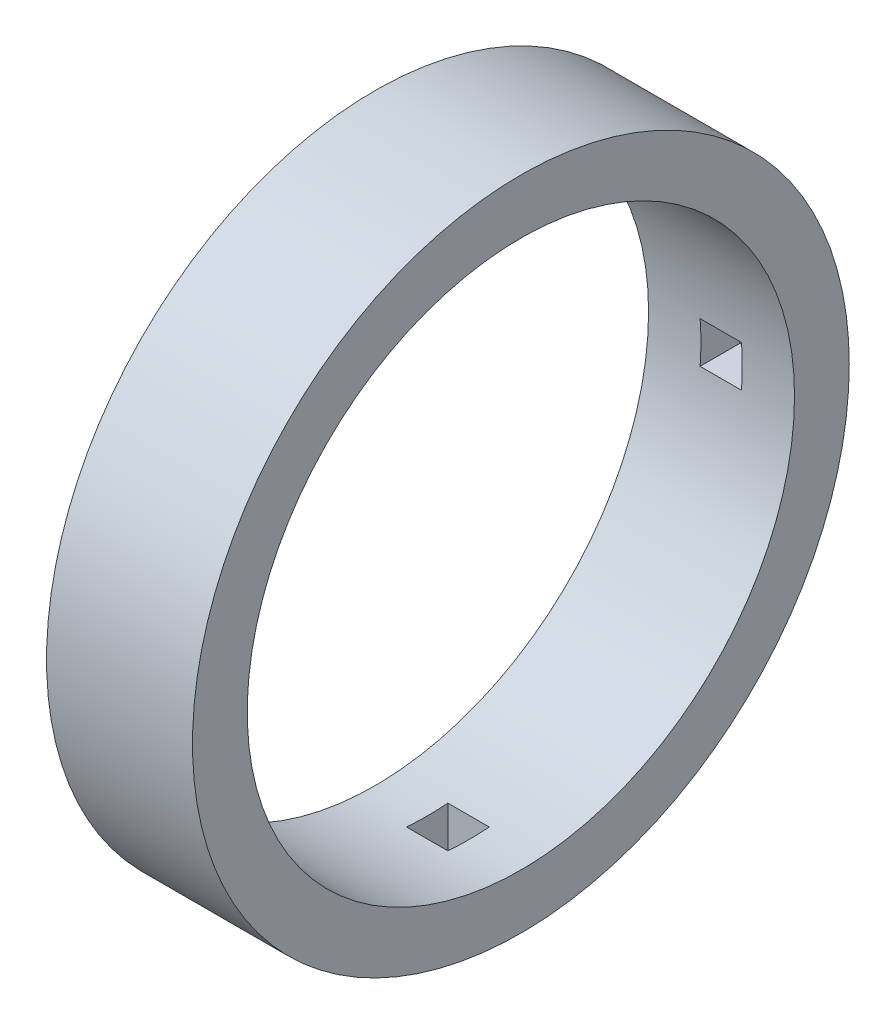
ISO-10303-21;
HEADER;
FILE_DESCRIPTION(('STEP AP214'),'2;1');
FILE_NAME('part.step','',(''),(''),'','','');
FILE_SCHEMA(('AUTOMOTIVE_DESIGN { 1 0 10303 214 1 1 1 1 }'));
ENDSEC;
DATA;
#1=APPLICATION_CONTEXT('core data for automotive mechanical design processes');
#2=APPLICATION_PROTOCOL_DEFINITION('international standard','automotive_design',2000,#1);
#3=PRODUCT_CONTEXT('',#1,'mechanical');
#4=PRODUCT('Part','Part','',(#3));
#5=PRODUCT_RELATED_PRODUCT_CATEGORY('part','',(#4));
#6=PRODUCT_DEFINITION_FORMATION('','',#4);
#7=PRODUCT_DEFINITION_CONTEXT('part definition',#1,'design');
#8=PRODUCT_DEFINITION('design','',#6,#7);
#9=PRODUCT_DEFINITION_SHAPE('','',#8);
#10=(LENGTH_UNIT() NAMED_UNIT(*) SI_UNIT(.MILLI.,.METRE.));
#11=(NAMED_UNIT(*) PLANE_ANGLE_UNIT() SI_UNIT($,.RADIAN.));
#12=(NAMED_UNIT(*) SI_UNIT($,.STERADIAN.) SOLID_ANGLE_UNIT());
#13=UNCERTAINTY_MEASURE_WITH_UNIT(LENGTH_MEASURE(1.E-05),#10,'distance_accuracy_value','');
#14=(GEOMETRIC_REPRESENTATION_CONTEXT(3) GLOBAL_UNCERTAINTY_ASSIGNED_CONTEXT((#13)) GLOBAL_UNIT_ASSIGNED_CONTEXT((#10,
#11,#12)) REPRESENTATION_CONTEXT('',''));
#15=CARTESIAN_POINT('',(0.,0.,0.));
#16=DIRECTION('',(0.,0.,1.));
#17=DIRECTION('',(1.,0.,0.));
#18=AXIS2_PLACEMENT_3D('',#15,#16,#17);
#19=CARTESIAN_POINT('',(12.,0.,0.));
#20=DIRECTION('',(-1.,0.,0.));
#21=DIRECTION('',(0.,0.,1.));
#22=AXIS2_PLACEMENT_3D('',#19,#20,#21);
#23=CYLINDRICAL_SURFACE('',#22,22.5);
#24=DIRECTION('',(-1.,0.,0.));
#25=VECTOR('',#24,1.);
#26=CARTESIAN_POINT('',(12.,-1.7,-22.4356858598083));
#27=LINE('',#26,#25);
#28=CARTESIAN_POINT('',(7.7,-1.7,-22.4356858598083));
#29=VERTEX_POINT('',#28);
#30=CARTESIAN_POINT('',(4.3,-1.7,-22.4356858598083));
#31=VERTEX_POINT('',#30);
#32=EDGE_CURVE('E253',#29,#31,#27,.T.);
#33=ORIENTED_EDGE('',*,*,#32,.T.);
#34=CARTESIAN_POINT('',(4.3,0.,0.));
#35=DIRECTION('',(1.,0.,0.));
#36=DIRECTION('',(0.,0.,-1.));
#37=AXIS2_PLACEMENT_3D('',#34,#35,#36);
#38=CIRCLE('',#37,22.5);
#39=CARTESIAN_POINT('',(4.3,1.7,-22.4356858598083));
#40=VERTEX_POINT('',#39);
#41=EDGE_CURVE('E261',#31,#40,#38,.T.);
#42=ORIENTED_EDGE('',*,*,#41,.T.);
#43=DIRECTION('',(-1.,0.,0.));
#44=VECTOR('',#43,1.);
#45=CARTESIAN_POINT('',(12.,1.7,-22.4356858598083));
#46=LINE('',#45,#44);
#47=CARTESIAN_POINT('',(7.7,1.7,-22.4356858598083));
#48=VERTEX_POINT('',#47);
#49=EDGE_CURVE('E250',#40,#48,#46,.F.);
#50=ORIENTED_EDGE('',*,*,#49,.T.);
#51=CARTESIAN_POINT('',(7.7,0.,0.));
#52=DIRECTION('',(1.,0.,0.));
#53=DIRECTION('',(0.,0.,-1.));
#54=AXIS2_PLACEMENT_3D('',#51,#52,#53);
#55=CIRCLE('',#54,22.5);
#56=EDGE_CURVE('E247',#29,#48,#55,.T.);
#57=ORIENTED_EDGE('',*,*,#56,.F.);
#58=EDGE_LOOP('',(#33,#42,#50,#57));
#59=FACE_BOUND('',#58,.T.);
#60=CARTESIAN_POINT('',(0.,0.,0.));
#61=DIRECTION('',(1.,0.,0.));
#62=DIRECTION('',(0.,0.,-1.));
#63=AXIS2_PLACEMENT_3D('',#60,#61,#62);
#64=CIRCLE('',#63,22.5);
#65=CARTESIAN_POINT('',(0.,0.,-22.5));
#66=VERTEX_POINT('',#65);
#67=EDGE_CURVE('E313',#66,#66,#64,.T.);
#68=ORIENTED_EDGE('',*,*,#67,.F.);
#69=EDGE_LOOP('',(#68));
#70=FACE_BOUND('',#69,.T.);
#71=CARTESIAN_POINT('',(12.,0.,0.));
#72=DIRECTION('',(1.,0.,0.));
#73=DIRECTION('',(0.,0.,-1.));
#74=AXIS2_PLACEMENT_3D('',#71,#72,#73);
#75=CIRCLE('',#74,22.5);
#76=CARTESIAN_POINT('',(12.,0.,-22.5));
#77=VERTEX_POINT('',#76);
#78=EDGE_CURVE('E314',#77,#77,#75,.T.);
#79=ORIENTED_EDGE('',*,*,#78,.T.);
#80=EDGE_LOOP('',(#79));
#81=FACE_BOUND('',#80,.T.);
#82=CARTESIAN_POINT('',(4.3,0.,0.));
#83=DIRECTION('',(-1.,0.,0.));
#84=DIRECTION('',(0.,0.,1.));
#85=AXIS2_PLACEMENT_3D('',#82,#83,#84);
#86=CIRCLE('',#85,22.5);
#87=CARTESIAN_POINT('',(4.3,-1.7,22.4356858598083));
#88=VERTEX_POINT('',#87);
#89=CARTESIAN_POINT('',(4.3,1.7,22.4356858598083));
#90=VERTEX_POINT('',#89);
#91=EDGE_CURVE('E336',#88,#90,#86,.T.);
#92=ORIENTED_EDGE('',*,*,#91,.F.);
#93=DIRECTION('',(-1.,0.,0.));
#94=VECTOR('',#93,1.);
#95=CARTESIAN_POINT('',(12.,-1.7,22.4356858598083));
#96=LINE('',#95,#94);
#97=CARTESIAN_POINT('',(7.7,-1.7,22.4356858598083));
#98=VERTEX_POINT('',#97);
#99=EDGE_CURVE('E330',#88,#98,#96,.F.);
#100=ORIENTED_EDGE('',*,*,#99,.T.);
#101=CARTESIAN_POINT('',(7.7,0.,0.));
#102=DIRECTION('',(-1.,0.,0.));
#103=DIRECTION('',(0.,0.,1.));
#104=AXIS2_PLACEMENT_3D('',#101,#102,#103);
#105=CIRCLE('',#104,22.5);
#106=CARTESIAN_POINT('',(7.7,1.7,22.4356858598083));
#107=VERTEX_POINT('',#106);
#108=EDGE_CURVE('E326',#98,#107,#105,.T.);
#109=ORIENTED_EDGE('',*,*,#108,.T.);
#110=DIRECTION('',(-1.,0.,0.));
#111=VECTOR('',#110,1.);
#112=CARTESIAN_POINT('',(12.,1.7,22.4356858598083));
#113=LINE('',#112,#111);
#114=EDGE_CURVE('E333',#107,#90,#113,.T.);
#115=ORIENTED_EDGE('',*,*,#114,.T.);
#116=EDGE_LOOP('',(#92,#100,#109,#115));
#117=FACE_BOUND('',#116,.T.);
#118=DIRECTION('',(-1.,0.,0.));
#119=VECTOR('',#118,1.);
#120=CARTESIAN_POINT('',(12.,22.4356858598082,-1.70000000000008));
#121=LINE('',#120,#119);
#122=CARTESIAN_POINT('',(7.7,22.4356858598082,-1.70000000000008));
#123=VERTEX_POINT('',#122);
#124=CARTESIAN_POINT('',(4.3,22.4356858598082,-1.70000000000008));
#125=VERTEX_POINT('',#124);
#126=EDGE_CURVE('E256',#123,#125,#121,.T.);
#127=ORIENTED_EDGE('',*,*,#126,.T.);
#128=CARTESIAN_POINT('',(4.3,0.,0.));
#129=DIRECTION('',(1.,0.,0.));
#130=DIRECTION('',(0.,0.,-1.));
#131=AXIS2_PLACEMENT_3D('',#128,#129,#130);
#132=CIRCLE('',#131,22.5);
#133=CARTESIAN_POINT('',(4.3,22.4356858598083,1.69999999999992));
#134=VERTEX_POINT('',#133);
#135=EDGE_CURVE('E251',#125,#134,#132,.T.);
#136=ORIENTED_EDGE('',*,*,#135,.T.);
#137=DIRECTION('',(-1.,0.,0.));
#138=VECTOR('',#137,1.);
#139=CARTESIAN_POINT('',(12.,22.4356858598083,1.69999999999992));
#140=LINE('',#139,#138);
#141=CARTESIAN_POINT('',(7.7,22.4356858598083,1.69999999999992));
#142=VERTEX_POINT('',#141);
#143=EDGE_CURVE('E340',#134,#142,#140,.F.);
#144=ORIENTED_EDGE('',*,*,#143,.T.);
#145=CARTESIAN_POINT('',(7.7,0.,0.));
#146=DIRECTION('',(1.,0.,0.));
#147=DIRECTION('',(0.,0.,-1.));
#148=AXIS2_PLACEMENT_3D('',#145,#146,#147);
#149=CIRCLE('',#148,22.5);
#150=EDGE_CURVE('E338',#123,#142,#149,.T.);
#151=ORIENTED_EDGE('',*,*,#150,.F.);
#152=EDGE_LOOP('',(#127,#136,#144,#151));
#153=FACE_BOUND('',#152,.T.);
#154=DIRECTION('',(-1.,0.,0.));
#155=VECTOR('',#154,1.);
#156=CARTESIAN_POINT('',(12.,-22.4356858598082,1.70000000000023));
#157=LINE('',#156,#155);
#158=CARTESIAN_POINT('',(7.7,-22.4356858598082,1.70000000000023));
#159=VERTEX_POINT('',#158);
#160=CARTESIAN_POINT('',(4.3,-22.4356858598082,1.70000000000023));
#161=VERTEX_POINT('',#160);
#162=EDGE_CURVE('E47',#159,#161,#157,.T.);
#163=ORIENTED_EDGE('',*,*,#162,.T.);
#164=CARTESIAN_POINT('',(4.3,0.,0.));
#165=DIRECTION('',(1.,0.,0.));
#166=DIRECTION('',(0.,0.,-1.));
#167=AXIS2_PLACEMENT_3D('',#164,#165,#166);
#168=CIRCLE('',#167,22.5);
#169=CARTESIAN_POINT('',(4.3,-22.4356858598083,-1.69999999999977));
#170=VERTEX_POINT('',#169);
#171=EDGE_CURVE('E12',#161,#170,#168,.T.);
#172=ORIENTED_EDGE('',*,*,#171,.T.);
#173=DIRECTION('',(-1.,0.,0.));
#174=VECTOR('',#173,1.);
#175=CARTESIAN_POINT('',(12.,-22.4356858598083,-1.69999999999977));
#176=LINE('',#175,#174);
#177=CARTESIAN_POINT('',(7.7,-22.4356858598083,-1.69999999999977));
#178=VERTEX_POINT('',#177);
#179=EDGE_CURVE('E264',#170,#178,#176,.F.);
#180=ORIENTED_EDGE('',*,*,#179,.T.);
#181=CARTESIAN_POINT('',(7.7,0.,0.));
#182=DIRECTION('',(1.,0.,0.));
#183=DIRECTION('',(0.,0.,-1.));
#184=AXIS2_PLACEMENT_3D('',#181,#182,#183);
#185=CIRCLE('',#184,22.5);
#186=EDGE_CURVE('E174',#159,#178,#185,.T.);
#187=ORIENTED_EDGE('',*,*,#186,.F.);
#188=EDGE_LOOP('',(#163,#172,#180,#187));
#189=FACE_BOUND('',#188,.T.);
#190=ADVANCED_FACE('F39',(#59,#70,#81,#117,#153,#189),#23,.F.);
#191=CARTESIAN_POINT('',(12.,0.,0.));
#192=DIRECTION('',(1.,0.,0.));
#193=DIRECTION('',(0.,0.,-1.));
#194=AXIS2_PLACEMENT_3D('',#191,#192,#193);
#195=PLANE('',#194);
#196=CARTESIAN_POINT('',(12.,0.,0.));
#197=DIRECTION('',(1.,0.,0.));
#198=DIRECTION('',(0.,0.,-1.));
#199=AXIS2_PLACEMENT_3D('',#196,#197,#198);
#200=CIRCLE('',#199,27.);
#201=CARTESIAN_POINT('',(12.,0.,-27.));
#202=VERTEX_POINT('',#201);
#203=EDGE_CURVE('E323',#202,#202,#200,.T.);
#204=ORIENTED_EDGE('',*,*,#203,.T.);
#205=EDGE_LOOP('',(#204));
#206=FACE_BOUND('',#205,.T.);
#207=ORIENTED_EDGE('',*,*,#78,.F.);
#208=EDGE_LOOP('',(#207));
#209=FACE_BOUND('',#208,.T.);
#210=ADVANCED_FACE('F288',(#206,#209),#195,.T.);
#211=CARTESIAN_POINT('',(0.,0.,0.));
#212=DIRECTION('',(1.,0.,0.));
#213=DIRECTION('',(0.,0.,-1.));
#214=AXIS2_PLACEMENT_3D('',#211,#212,#213);
#215=PLANE('',#214);
#216=CARTESIAN_POINT('',(0.,0.,0.));
#217=DIRECTION('',(1.,0.,0.));
#218=DIRECTION('',(0.,0.,-1.));
#219=AXIS2_PLACEMENT_3D('',#216,#217,#218);
#220=CIRCLE('',#219,27.);
#221=CARTESIAN_POINT('',(0.,0.,-27.));
#222=VERTEX_POINT('',#221);
#223=EDGE_CURVE('E310',#222,#222,#220,.T.);
#224=ORIENTED_EDGE('',*,*,#223,.F.);
#225=EDGE_LOOP('',(#224));
#226=FACE_BOUND('',#225,.T.);
#227=ORIENTED_EDGE('',*,*,#67,.T.);
#228=EDGE_LOOP('',(#227));
#229=FACE_BOUND('',#228,.T.);
#230=ADVANCED_FACE('F293',(#226,#229),#215,.F.);
#231=CARTESIAN_POINT('',(12.,0.,0.));
#232=DIRECTION('',(-1.,0.,0.));
#233=DIRECTION('',(0.,0.,1.));
#234=AXIS2_PLACEMENT_3D('',#231,#232,#233);
#235=CYLINDRICAL_SURFACE('',#234,27.);
#236=ORIENTED_EDGE('',*,*,#203,.F.);
#237=EDGE_LOOP('',(#236));
#238=FACE_BOUND('',#237,.T.);
#239=ORIENTED_EDGE('',*,*,#223,.T.);
#240=EDGE_LOOP('',(#239));
#241=FACE_BOUND('',#240,.T.);
#242=ADVANCED_FACE('F41',(#238,#241),#235,.T.);
#243=CARTESIAN_POINT('',(4.3,0.,0.));
#244=DIRECTION('',(-1.,0.,0.));
#245=DIRECTION('',(0.,0.,1.));
#246=AXIS2_PLACEMENT_3D('',#243,#244,#245);
#247=PLANE('',#246);
#248=ORIENTED_EDGE('',*,*,#91,.T.);
#249=DIRECTION('',(0.,0.,1.));
#250=VECTOR('',#249,1.);
#251=CARTESIAN_POINT('',(4.3,1.7,25.7));
#252=LINE('',#251,#250);
#253=CARTESIAN_POINT('',(4.3,1.7,25.7));
#254=VERTEX_POINT('',#253);
#255=EDGE_CURVE('E564',#90,#254,#252,.T.);
#256=ORIENTED_EDGE('',*,*,#255,.T.);
#257=DIRECTION('',(0.,-1.,0.));
#258=VECTOR('',#257,1.);
#259=CARTESIAN_POINT('',(4.3,1.7,25.7));
#260=LINE('',#259,#258);
#261=CARTESIAN_POINT('',(4.3,-1.7,25.7));
#262=VERTEX_POINT('',#261);
#263=EDGE_CURVE('E315',#254,#262,#260,.T.);
#264=ORIENTED_EDGE('',*,*,#263,.T.);
#265=DIRECTION('',(0.,0.,-1.));
#266=VECTOR('',#265,1.);
#267=CARTESIAN_POINT('',(4.3,-1.7,25.7));
#268=LINE('',#267,#266);
#269=EDGE_CURVE('E567',#262,#88,#268,.T.);
#270=ORIENTED_EDGE('',*,*,#269,.T.);
#271=EDGE_LOOP('',(#248,#256,#264,#270));
#272=FACE_BOUND('',#271,.T.);
#273=ADVANCED_FACE('F298',(#272),#247,.F.);
#274=CARTESIAN_POINT('',(6.,1.7,25.7));
#275=DIRECTION('',(0.,-1.,0.));
#276=DIRECTION('',(0.,0.,-1.));
#277=AXIS2_PLACEMENT_3D('',#274,#275,#276);
#278=PLANE('',#277);
#279=DIRECTION('',(0.,0.,1.));
#280=VECTOR('',#279,1.);
#281=CARTESIAN_POINT('',(7.7,1.7,25.7));
#282=LINE('',#281,#280);
#283=CARTESIAN_POINT('',(7.7,1.7,25.7));
#284=VERTEX_POINT('',#283);
#285=EDGE_CURVE('E374',#107,#284,#282,.T.);
#286=ORIENTED_EDGE('',*,*,#285,.T.);
#287=DIRECTION('',(-1.,0.,0.));
#288=VECTOR('',#287,1.);
#289=CARTESIAN_POINT('',(6.,1.7,25.7));
#290=LINE('',#289,#288);
#291=EDGE_CURVE('E571',#284,#254,#290,.T.);
#292=ORIENTED_EDGE('',*,*,#291,.T.);
#293=ORIENTED_EDGE('',*,*,#255,.F.);
#294=ORIENTED_EDGE('',*,*,#114,.F.);
#295=EDGE_LOOP('',(#286,#292,#293,#294));
#296=FACE_BOUND('',#295,.T.);
#297=ADVANCED_FACE('F502',(#296),#278,.T.);
#298=CARTESIAN_POINT('',(6.,-1.7,25.7));
#299=DIRECTION('',(0.,1.,0.));
#300=DIRECTION('',(0.,0.,1.));
#301=AXIS2_PLACEMENT_3D('',#298,#299,#300);
#302=PLANE('',#301);
#303=ORIENTED_EDGE('',*,*,#269,.F.);
#304=DIRECTION('',(-1.,0.,0.));
#305=VECTOR('',#304,1.);
#306=CARTESIAN_POINT('',(6.,-1.7,25.7));
#307=LINE('',#306,#305);
#308=CARTESIAN_POINT('',(7.7,-1.7,25.7));
#309=VERTEX_POINT('',#308);
#310=EDGE_CURVE('E319',#309,#262,#307,.T.);
#311=ORIENTED_EDGE('',*,*,#310,.F.);
#312=DIRECTION('',(0.,0.,-1.));
#313=VECTOR('',#312,1.);
#314=CARTESIAN_POINT('',(7.7,-1.7,25.7));
#315=LINE('',#314,#313);
#316=EDGE_CURVE('E577',#309,#98,#315,.T.);
#317=ORIENTED_EDGE('',*,*,#316,.T.);
#318=ORIENTED_EDGE('',*,*,#99,.F.);
#319=EDGE_LOOP('',(#303,#311,#317,#318));
#320=FACE_BOUND('',#319,.T.);
#321=ADVANCED_FACE('F493',(#320),#302,.T.);
#322=CARTESIAN_POINT('',(6.,1.7,25.7));
#323=DIRECTION('',(0.,0.,-1.));
#324=DIRECTION('',(-1.,0.,0.));
#325=AXIS2_PLACEMENT_3D('',#322,#323,#324);
#326=PLANE('',#325);
#327=ORIENTED_EDGE('',*,*,#263,.F.);
#328=ORIENTED_EDGE('',*,*,#291,.F.);
#329=DIRECTION('',(0.,-1.,0.));
#330=VECTOR('',#329,1.);
#331=CARTESIAN_POINT('',(7.7,1.7,25.7));
#332=LINE('',#331,#330);
#333=EDGE_CURVE('E573',#284,#309,#332,.T.);
#334=ORIENTED_EDGE('',*,*,#333,.T.);
#335=ORIENTED_EDGE('',*,*,#310,.T.);
#336=EDGE_LOOP('',(#327,#328,#334,#335));
#337=FACE_BOUND('',#336,.T.);
#338=ADVANCED_FACE('F306',(#337),#326,.T.);
#339=CARTESIAN_POINT('',(7.7,0.,0.));
#340=DIRECTION('',(-1.,0.,0.));
#341=DIRECTION('',(0.,0.,1.));
#342=AXIS2_PLACEMENT_3D('',#339,#340,#341);
#343=PLANE('',#342);
#344=ORIENTED_EDGE('',*,*,#316,.F.);
#345=ORIENTED_EDGE('',*,*,#333,.F.);
#346=ORIENTED_EDGE('',*,*,#285,.F.);
#347=ORIENTED_EDGE('',*,*,#108,.F.);
#348=EDGE_LOOP('',(#344,#345,#346,#347));
#349=FACE_BOUND('',#348,.T.);
#350=ADVANCED_FACE('F400',(#349),#343,.T.);
#351=CARTESIAN_POINT('',(4.3,0.,0.));
#352=DIRECTION('',(1.,0.,0.));
#353=DIRECTION('',(0.,0.,-1.));
#354=AXIS2_PLACEMENT_3D('',#351,#352,#353);
#355=PLANE('',#354);
#356=DIRECTION('',(0.,1.,0.));
#357=VECTOR('',#356,1.);
#358=CARTESIAN_POINT('',(4.3,25.7,-1.70000000000009));
#359=LINE('',#358,#357);
#360=CARTESIAN_POINT('',(4.3,25.7,-1.70000000000009));
#361=VERTEX_POINT('',#360);
#362=EDGE_CURVE('E351',#125,#361,#359,.T.);
#363=ORIENTED_EDGE('',*,*,#362,.T.);
#364=DIRECTION('',(0.,0.,1.));
#365=VECTOR('',#364,1.);
#366=CARTESIAN_POINT('',(4.3,25.7,-1.70000000000009));
#367=LINE('',#366,#365);
#368=CARTESIAN_POINT('',(4.3,25.7,1.69999999999991));
#369=VERTEX_POINT('',#368);
#370=EDGE_CURVE('E372',#361,#369,#367,.T.);
#371=ORIENTED_EDGE('',*,*,#370,.T.);
#372=DIRECTION('',(0.,-1.,0.));
#373=VECTOR('',#372,1.);
#374=CARTESIAN_POINT('',(4.3,25.7,1.69999999999991));
#375=LINE('',#374,#373);
#376=EDGE_CURVE('E357',#369,#134,#375,.T.);
#377=ORIENTED_EDGE('',*,*,#376,.T.);
#378=ORIENTED_EDGE('',*,*,#135,.F.);
#379=EDGE_LOOP('',(#363,#371,#377,#378));
#380=FACE_BOUND('',#379,.T.);
#381=ADVANCED_FACE('F398',(#380),#355,.T.);
#382=CARTESIAN_POINT('',(6.,25.7,-1.70000000000009));
#383=DIRECTION('',(0.,0.,1.));
#384=DIRECTION('',(0.,-1.,0.));
#385=AXIS2_PLACEMENT_3D('',#382,#383,#384);
#386=PLANE('',#385);
#387=DIRECTION('',(0.,1.,0.));
#388=VECTOR('',#387,1.);
#389=CARTESIAN_POINT('',(7.7,25.7,-1.70000000000009));
#390=LINE('',#389,#388);
#391=CARTESIAN_POINT('',(7.7,25.7,-1.70000000000009));
#392=VERTEX_POINT('',#391);
#393=EDGE_CURVE('E217',#123,#392,#390,.T.);
#394=ORIENTED_EDGE('',*,*,#393,.T.);
#395=DIRECTION('',(-1.,0.,0.));
#396=VECTOR('',#395,1.);
#397=CARTESIAN_POINT('',(6.,25.7,-1.70000000000009));
#398=LINE('',#397,#396);
#399=EDGE_CURVE('E352',#392,#361,#398,.T.);
#400=ORIENTED_EDGE('',*,*,#399,.T.);
#401=ORIENTED_EDGE('',*,*,#362,.F.);
#402=ORIENTED_EDGE('',*,*,#126,.F.);
#403=EDGE_LOOP('',(#394,#400,#401,#402));
#404=FACE_BOUND('',#403,.T.);
#405=ADVANCED_FACE('F348',(#404),#386,.T.);
#406=CARTESIAN_POINT('',(6.,25.7,1.69999999999991));
#407=DIRECTION('',(0.,0.,-1.));
#408=DIRECTION('',(0.,1.,0.));
#409=AXIS2_PLACEMENT_3D('',#406,#407,#408);
#410=PLANE('',#409);
#411=ORIENTED_EDGE('',*,*,#376,.F.);
#412=DIRECTION('',(-1.,0.,0.));
#413=VECTOR('',#412,1.);
#414=CARTESIAN_POINT('',(6.,25.7,1.69999999999991));
#415=LINE('',#414,#413);
#416=CARTESIAN_POINT('',(7.7,25.7,1.69999999999991));
#417=VERTEX_POINT('',#416);
#418=EDGE_CURVE('E375',#417,#369,#415,.T.);
#419=ORIENTED_EDGE('',*,*,#418,.F.);
#420=DIRECTION('',(0.,-1.,0.));
#421=VECTOR('',#420,1.);
#422=CARTESIAN_POINT('',(7.7,25.7,1.69999999999991));
#423=LINE('',#422,#421);
#424=EDGE_CURVE('E360',#417,#142,#423,.T.);
#425=ORIENTED_EDGE('',*,*,#424,.T.);
#426=ORIENTED_EDGE('',*,*,#143,.F.);
#427=EDGE_LOOP('',(#411,#419,#425,#426));
#428=FACE_BOUND('',#427,.T.);
#429=ADVANCED_FACE('F393',(#428),#410,.T.);
#430=CARTESIAN_POINT('',(6.,25.7,-1.70000000000009));
#431=DIRECTION('',(0.,-1.,0.));
#432=DIRECTION('',(0.,0.,-1.));
#433=AXIS2_PLACEMENT_3D('',#430,#431,#432);
#434=PLANE('',#433);
#435=ORIENTED_EDGE('',*,*,#370,.F.);
#436=ORIENTED_EDGE('',*,*,#399,.F.);
#437=DIRECTION('',(0.,0.,1.));
#438=VECTOR('',#437,1.);
#439=CARTESIAN_POINT('',(7.7,25.7,-1.70000000000009));
#440=LINE('',#439,#438);
#441=EDGE_CURVE('E355',#392,#417,#440,.T.);
#442=ORIENTED_EDGE('',*,*,#441,.T.);
#443=ORIENTED_EDGE('',*,*,#418,.T.);
#444=EDGE_LOOP('',(#435,#436,#442,#443));
#445=FACE_BOUND('',#444,.T.);
#446=ADVANCED_FACE('F397',(#445),#434,.T.);
#447=CARTESIAN_POINT('',(7.7,0.,0.));
#448=DIRECTION('',(1.,0.,0.));
#449=DIRECTION('',(0.,0.,-1.));
#450=AXIS2_PLACEMENT_3D('',#447,#448,#449);
#451=PLANE('',#450);
#452=ORIENTED_EDGE('',*,*,#150,.T.);
#453=ORIENTED_EDGE('',*,*,#424,.F.);
#454=ORIENTED_EDGE('',*,*,#441,.F.);
#455=ORIENTED_EDGE('',*,*,#393,.F.);
#456=EDGE_LOOP('',(#452,#453,#454,#455));
#457=FACE_BOUND('',#456,.T.);
#458=ADVANCED_FACE('F396',(#457),#451,.F.);
#459=CARTESIAN_POINT('',(4.3,0.,0.));
#460=DIRECTION('',(1.,0.,0.));
#461=DIRECTION('',(0.,0.,-1.));
#462=AXIS2_PLACEMENT_3D('',#459,#460,#461);
#463=PLANE('',#462);
#464=DIRECTION('',(0.,0.,-1.));
#465=VECTOR('',#464,1.);
#466=CARTESIAN_POINT('',(4.3,-1.7,-25.7));
#467=LINE('',#466,#465);
#468=CARTESIAN_POINT('',(4.3,-1.7,-25.7));
#469=VERTEX_POINT('',#468);
#470=EDGE_CURVE('E204',#31,#469,#467,.T.);
#471=ORIENTED_EDGE('',*,*,#470,.T.);
#472=DIRECTION('',(0.,1.,0.));
#473=VECTOR('',#472,1.);
#474=CARTESIAN_POINT('',(4.3,-1.7,-25.7));
#475=LINE('',#474,#473);
#476=CARTESIAN_POINT('',(4.3,1.7,-25.7));
#477=VERTEX_POINT('',#476);
#478=EDGE_CURVE('E215',#469,#477,#475,.T.);
#479=ORIENTED_EDGE('',*,*,#478,.T.);
#480=DIRECTION('',(0.,0.,1.));
#481=VECTOR('',#480,1.);
#482=CARTESIAN_POINT('',(4.3,1.7,-25.7));
#483=LINE('',#482,#481);
#484=EDGE_CURVE('E220',#477,#40,#483,.T.);
#485=ORIENTED_EDGE('',*,*,#484,.T.);
#486=ORIENTED_EDGE('',*,*,#41,.F.);
#487=EDGE_LOOP('',(#471,#479,#485,#486));
#488=FACE_BOUND('',#487,.T.);
#489=ADVANCED_FACE('F283',(#488),#463,.T.);
#490=CARTESIAN_POINT('',(6.,-1.7,-25.7));
#491=DIRECTION('',(0.,1.,0.));
#492=DIRECTION('',(0.,0.,1.));
#493=AXIS2_PLACEMENT_3D('',#490,#491,#492);
#494=PLANE('',#493);
#495=DIRECTION('',(0.,0.,-1.));
#496=VECTOR('',#495,1.);
#497=CARTESIAN_POINT('',(7.7,-1.7,-25.7));
#498=LINE('',#497,#496);
#499=CARTESIAN_POINT('',(7.7,-1.7,-25.7));
#500=VERTEX_POINT('',#499);
#501=EDGE_CURVE('E62',#29,#500,#498,.T.);
#502=ORIENTED_EDGE('',*,*,#501,.T.);
#503=DIRECTION('',(-1.,0.,0.));
#504=VECTOR('',#503,1.);
#505=CARTESIAN_POINT('',(6.,-1.7,-25.7));
#506=LINE('',#505,#504);
#507=EDGE_CURVE('E207',#500,#469,#506,.T.);
#508=ORIENTED_EDGE('',*,*,#507,.T.);
#509=ORIENTED_EDGE('',*,*,#470,.F.);
#510=ORIENTED_EDGE('',*,*,#32,.F.);
#511=EDGE_LOOP('',(#502,#508,#509,#510));
#512=FACE_BOUND('',#511,.T.);
#513=ADVANCED_FACE('F416',(#512),#494,.T.);
#514=CARTESIAN_POINT('',(6.,1.7,-25.7));
#515=DIRECTION('',(0.,-1.,0.));
#516=DIRECTION('',(0.,0.,-1.));
#517=AXIS2_PLACEMENT_3D('',#514,#515,#516);
#518=PLANE('',#517);
#519=ORIENTED_EDGE('',*,*,#484,.F.);
#520=DIRECTION('',(-1.,0.,0.));
#521=VECTOR('',#520,1.);
#522=CARTESIAN_POINT('',(6.,1.7,-25.7));
#523=LINE('',#522,#521);
#524=CARTESIAN_POINT('',(7.7,1.7,-25.7));
#525=VERTEX_POINT('',#524);
#526=EDGE_CURVE('E218',#525,#477,#523,.T.);
#527=ORIENTED_EDGE('',*,*,#526,.F.);
#528=DIRECTION('',(0.,0.,1.));
#529=VECTOR('',#528,1.);
#530=CARTESIAN_POINT('',(7.7,1.7,-25.7));
#531=LINE('',#530,#529);
#532=EDGE_CURVE('E201',#525,#48,#531,.T.);
#533=ORIENTED_EDGE('',*,*,#532,.T.);
#534=ORIENTED_EDGE('',*,*,#49,.F.);
#535=EDGE_LOOP('',(#519,#527,#533,#534));
#536=FACE_BOUND('',#535,.T.);
#537=ADVANCED_FACE('F419',(#536),#518,.T.);
#538=CARTESIAN_POINT('',(6.,-1.7,-25.7));
#539=DIRECTION('',(0.,0.,1.));
#540=DIRECTION('',(1.,0.,0.));
#541=AXIS2_PLACEMENT_3D('',#538,#539,#540);
#542=PLANE('',#541);
#543=ORIENTED_EDGE('',*,*,#478,.F.);
#544=ORIENTED_EDGE('',*,*,#507,.F.);
#545=DIRECTION('',(0.,1.,0.));
#546=VECTOR('',#545,1.);
#547=CARTESIAN_POINT('',(7.7,-1.7,-25.7));
#548=LINE('',#547,#546);
#549=EDGE_CURVE('E196',#500,#525,#548,.T.);
#550=ORIENTED_EDGE('',*,*,#549,.T.);
#551=ORIENTED_EDGE('',*,*,#526,.T.);
#552=EDGE_LOOP('',(#543,#544,#550,#551));
#553=FACE_BOUND('',#552,.T.);
#554=ADVANCED_FACE('F244',(#553),#542,.T.);
#555=CARTESIAN_POINT('',(7.7,0.,0.));
#556=DIRECTION('',(1.,0.,0.));
#557=DIRECTION('',(0.,0.,-1.));
#558=AXIS2_PLACEMENT_3D('',#555,#556,#557);
#559=PLANE('',#558);
#560=ORIENTED_EDGE('',*,*,#56,.T.);
#561=ORIENTED_EDGE('',*,*,#532,.F.);
#562=ORIENTED_EDGE('',*,*,#549,.F.);
#563=ORIENTED_EDGE('',*,*,#501,.F.);
#564=EDGE_LOOP('',(#560,#561,#562,#563));
#565=FACE_BOUND('',#564,.T.);
#566=ADVANCED_FACE('F245',(#565),#559,.F.);
#567=CARTESIAN_POINT('',(4.3,0.,0.));
#568=DIRECTION('',(1.,0.,0.));
#569=DIRECTION('',(0.,0.,-1.));
#570=AXIS2_PLACEMENT_3D('',#567,#568,#569);
#571=PLANE('',#570);
#572=DIRECTION('',(0.,-1.,0.));
#573=VECTOR('',#572,1.);
#574=CARTESIAN_POINT('',(4.3,-25.7,1.70000000000027));
#575=LINE('',#574,#573);
#576=CARTESIAN_POINT('',(4.3,-25.7,1.70000000000027));
#577=VERTEX_POINT('',#576);
#578=EDGE_CURVE('E170',#161,#577,#575,.T.);
#579=ORIENTED_EDGE('',*,*,#578,.T.);
#580=DIRECTION('',(0.,0.,-1.));
#581=VECTOR('',#580,1.);
#582=CARTESIAN_POINT('',(4.3,-25.7,1.70000000000027));
#583=LINE('',#582,#581);
#584=CARTESIAN_POINT('',(4.3,-25.7,-1.69999999999973));
#585=VERTEX_POINT('',#584);
#586=EDGE_CURVE('E163',#577,#585,#583,.T.);
#587=ORIENTED_EDGE('',*,*,#586,.T.);
#588=DIRECTION('',(0.,1.,0.));
#589=VECTOR('',#588,1.);
#590=CARTESIAN_POINT('',(4.3,-25.7,-1.69999999999973));
#591=LINE('',#590,#589);
#592=EDGE_CURVE('E160',#585,#170,#591,.T.);
#593=ORIENTED_EDGE('',*,*,#592,.T.);
#594=ORIENTED_EDGE('',*,*,#171,.F.);
#595=EDGE_LOOP('',(#579,#587,#593,#594));
#596=FACE_BOUND('',#595,.T.);
#597=ADVANCED_FACE('F271',(#596),#571,.T.);
#598=CARTESIAN_POINT('',(6.,-25.7,1.70000000000027));
#599=DIRECTION('',(0.,0.,-1.));
#600=DIRECTION('',(0.,1.,0.));
#601=AXIS2_PLACEMENT_3D('',#598,#599,#600);
#602=PLANE('',#601);
#603=DIRECTION('',(0.,-1.,0.));
#604=VECTOR('',#603,1.);
#605=CARTESIAN_POINT('',(7.7,-25.7,1.70000000000027));
#606=LINE('',#605,#604);
#607=CARTESIAN_POINT('',(7.7,-25.7,1.70000000000027));
#608=VERTEX_POINT('',#607);
#609=EDGE_CURVE('E54',#159,#608,#606,.T.);
#610=ORIENTED_EDGE('',*,*,#609,.T.);
#611=DIRECTION('',(-1.,0.,0.));
#612=VECTOR('',#611,1.);
#613=CARTESIAN_POINT('',(6.,-25.7,1.70000000000027));
#614=LINE('',#613,#612);
#615=EDGE_CURVE('E169',#608,#577,#614,.T.);
#616=ORIENTED_EDGE('',*,*,#615,.T.);
#617=ORIENTED_EDGE('',*,*,#578,.F.);
#618=ORIENTED_EDGE('',*,*,#162,.F.);
#619=EDGE_LOOP('',(#610,#616,#617,#618));
#620=FACE_BOUND('',#619,.T.);
#621=ADVANCED_FACE('F269',(#620),#602,.T.);
#622=CARTESIAN_POINT('',(6.,-25.7,-1.69999999999973));
#623=DIRECTION('',(0.,0.,1.));
#624=DIRECTION('',(0.,-1.,0.));
#625=AXIS2_PLACEMENT_3D('',#622,#623,#624);
#626=PLANE('',#625);
#627=ORIENTED_EDGE('',*,*,#592,.F.);
#628=DIRECTION('',(-1.,0.,0.));
#629=VECTOR('',#628,1.);
#630=CARTESIAN_POINT('',(6.,-25.7,-1.69999999999973));
#631=LINE('',#630,#629);
#632=CARTESIAN_POINT('',(7.7,-25.7,-1.69999999999973));
#633=VERTEX_POINT('',#632);
#634=EDGE_CURVE('E153',#633,#585,#631,.T.);
#635=ORIENTED_EDGE('',*,*,#634,.F.);
#636=DIRECTION('',(0.,1.,0.));
#637=VECTOR('',#636,1.);
#638=CARTESIAN_POINT('',(7.7,-25.7,-1.69999999999973));
#639=LINE('',#638,#637);
#640=EDGE_CURVE('E157',#633,#178,#639,.T.);
#641=ORIENTED_EDGE('',*,*,#640,.T.);
#642=ORIENTED_EDGE('',*,*,#179,.F.);
#643=EDGE_LOOP('',(#627,#635,#641,#642));
#644=FACE_BOUND('',#643,.T.);
#645=ADVANCED_FACE('F155',(#644),#626,.T.);
#646=CARTESIAN_POINT('',(6.,-25.7,1.70000000000027));
#647=DIRECTION('',(0.,1.,0.));
#648=DIRECTION('',(0.,0.,1.));
#649=AXIS2_PLACEMENT_3D('',#646,#647,#648);
#650=PLANE('',#649);
#651=ORIENTED_EDGE('',*,*,#586,.F.);
#652=ORIENTED_EDGE('',*,*,#615,.F.);
#653=DIRECTION('',(0.,0.,-1.));
#654=VECTOR('',#653,1.);
#655=CARTESIAN_POINT('',(7.7,-25.7,1.70000000000027));
#656=LINE('',#655,#654);
#657=EDGE_CURVE('E166',#608,#633,#656,.T.);
#658=ORIENTED_EDGE('',*,*,#657,.T.);
#659=ORIENTED_EDGE('',*,*,#634,.T.);
#660=EDGE_LOOP('',(#651,#652,#658,#659));
#661=FACE_BOUND('',#660,.T.);
#662=ADVANCED_FACE('F167',(#661),#650,.T.);
#663=CARTESIAN_POINT('',(7.7,0.,0.));
#664=DIRECTION('',(1.,0.,0.));
#665=DIRECTION('',(0.,0.,-1.));
#666=AXIS2_PLACEMENT_3D('',#663,#664,#665);
#667=PLANE('',#666);
#668=ORIENTED_EDGE('',*,*,#186,.T.);
#669=ORIENTED_EDGE('',*,*,#640,.F.);
#670=ORIENTED_EDGE('',*,*,#657,.F.);
#671=ORIENTED_EDGE('',*,*,#609,.F.);
#672=EDGE_LOOP('',(#668,#669,#670,#671));
#673=FACE_BOUND('',#672,.T.);
#674=ADVANCED_FACE('F172',(#673),#667,.F.);
#675=CLOSED_SHELL('',(#190,#210,#230,#242,#273,#297,#321,#338,#350,#381,#405,#429,#446,#458,
#489,#513,#537,#554,#566,#597,#621,#645,#662,#674));
#676=MANIFOLD_SOLID_BREP('B2',#675);
#677=ADVANCED_BREP_SHAPE_REPRESENTATION('',(#18,#676),#14);
#678=SHAPE_DEFINITION_REPRESENTATION(#9,#677);
ENDSEC;
END-ISO-10303-21;
